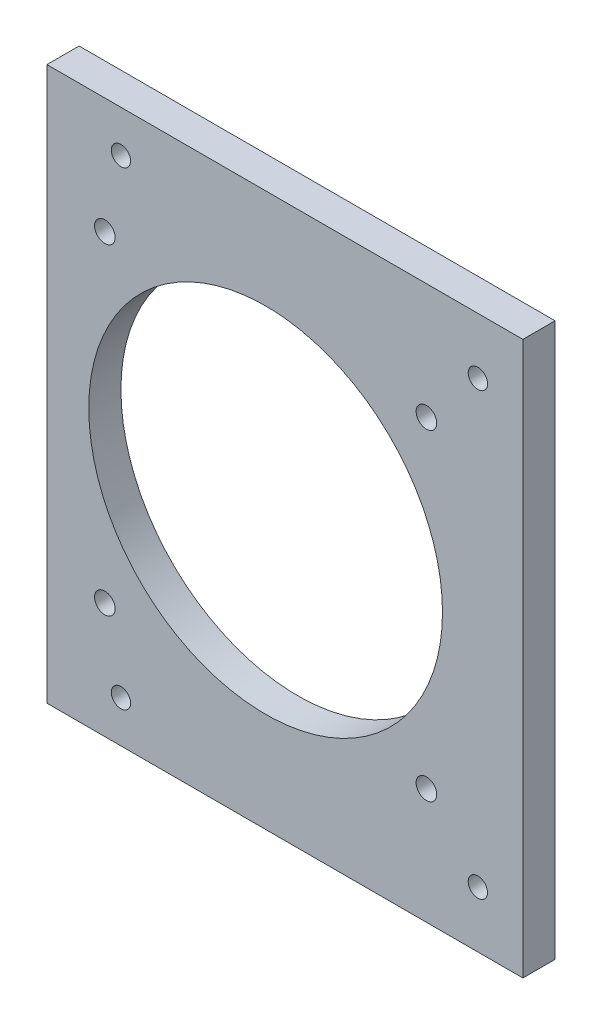
ISO-10303-21;
HEADER;
FILE_DESCRIPTION(('STEP AP214'),'2;1');
FILE_NAME('part.step','',(''),(''),'','','');
FILE_SCHEMA(('AUTOMOTIVE_DESIGN { 1 0 10303 214 1 1 1 1 }'));
ENDSEC;
DATA;
#1=APPLICATION_CONTEXT('core data for automotive mechanical design processes');
#2=APPLICATION_PROTOCOL_DEFINITION('international standard','automotive_design',2000,#1);
#3=PRODUCT_CONTEXT('',#1,'mechanical');
#4=PRODUCT('Part','Part','',(#3));
#5=PRODUCT_RELATED_PRODUCT_CATEGORY('part','',(#4));
#6=PRODUCT_DEFINITION_FORMATION('','',#4);
#7=PRODUCT_DEFINITION_CONTEXT('part definition',#1,'design');
#8=PRODUCT_DEFINITION('design','',#6,#7);
#9=PRODUCT_DEFINITION_SHAPE('','',#8);
#10=(LENGTH_UNIT() NAMED_UNIT(*) SI_UNIT(.MILLI.,.METRE.));
#11=(NAMED_UNIT(*) PLANE_ANGLE_UNIT() SI_UNIT($,.RADIAN.));
#12=(NAMED_UNIT(*) SI_UNIT($,.STERADIAN.) SOLID_ANGLE_UNIT());
#13=UNCERTAINTY_MEASURE_WITH_UNIT(LENGTH_MEASURE(1.E-05),#10,'distance_accuracy_value','');
#14=(GEOMETRIC_REPRESENTATION_CONTEXT(3) GLOBAL_UNCERTAINTY_ASSIGNED_CONTEXT((#13)) GLOBAL_UNIT_ASSIGNED_CONTEXT((#10,
#11,#12)) REPRESENTATION_CONTEXT('',''));
#15=CARTESIAN_POINT('',(0.,0.,0.));
#16=DIRECTION('',(0.,0.,1.));
#17=DIRECTION('',(1.,0.,0.));
#18=AXIS2_PLACEMENT_3D('',#15,#16,#17);
#19=CARTESIAN_POINT('',(2.50000000000003,-4.99999999999999,76.0000000000007));
#20=DIRECTION('',(1.,0.,0.));
#21=DIRECTION('',(0.,1.,0.));
#22=AXIS2_PLACEMENT_3D('',#19,#20,#21);
#23=PLANE('',#22);
#24=DIRECTION('',(0.,1.,0.));
#25=VECTOR('',#24,1.);
#26=CARTESIAN_POINT('',(2.50000000000003,-4.99999999999999,81.0000000000007));
#27=LINE('',#26,#25);
#28=CARTESIAN_POINT('',(2.50000000000003,2.00000000000001,81.0000000000007));
#29=VERTEX_POINT('',#28);
#30=CARTESIAN_POINT('',(2.50000000000002,88.,81.0000000000007));
#31=VERTEX_POINT('',#30);
#32=EDGE_CURVE('E37',#29,#31,#27,.T.);
#33=ORIENTED_EDGE('',*,*,#32,.F.);
#34=DIRECTION('',(0.,0.,1.));
#35=VECTOR('',#34,1.);
#36=CARTESIAN_POINT('',(2.50000000000003,2.00000000000001,76.0000000000007));
#37=LINE('',#36,#35);
#38=CARTESIAN_POINT('',(2.50000000000003,2.00000000000001,76.0000000000007));
#39=VERTEX_POINT('',#38);
#40=EDGE_CURVE('E73',#39,#29,#37,.T.);
#41=ORIENTED_EDGE('',*,*,#40,.F.);
#42=DIRECTION('',(0.,1.,0.));
#43=VECTOR('',#42,1.);
#44=CARTESIAN_POINT('',(2.50000000000003,-4.99999999999999,76.0000000000007));
#45=LINE('',#44,#43);
#46=CARTESIAN_POINT('',(2.50000000000002,88.,76.0000000000007));
#47=VERTEX_POINT('',#46);
#48=EDGE_CURVE('E11',#39,#47,#45,.T.);
#49=ORIENTED_EDGE('',*,*,#48,.T.);
#50=DIRECTION('',(0.,0.,-1.));
#51=VECTOR('',#50,1.);
#52=CARTESIAN_POINT('',(2.50000000000002,88.,81.0000000000007));
#53=LINE('',#52,#51);
#54=EDGE_CURVE('E90',#31,#47,#53,.T.);
#55=ORIENTED_EDGE('',*,*,#54,.F.);
#56=EDGE_LOOP('',(#33,#41,#49,#55));
#57=FACE_BOUND('',#56,.T.);
#58=ADVANCED_FACE('F34',(#57),#23,.T.);
#59=CARTESIAN_POINT('',(0.,0.,76.0000000000007));
#60=DIRECTION('',(0.,0.,1.));
#61=DIRECTION('',(1.,0.,0.));
#62=AXIS2_PLACEMENT_3D('',#59,#60,#61);
#63=PLANE('',#62);
#64=CARTESIAN_POINT('',(-37.4999999999983,45.,76.0000000000007));
#65=DIRECTION('',(0.,0.,1.));
#66=DIRECTION('',(1.,0.,0.));
#67=AXIS2_PLACEMENT_3D('',#64,#65,#66);
#68=CIRCLE('',#67,27.5);
#69=CARTESIAN_POINT('',(-9.9999999999983,45.,76.0000000000007));
#70=VERTEX_POINT('',#69);
#71=EDGE_CURVE('E140',#70,#70,#68,.T.);
#72=ORIENTED_EDGE('',*,*,#71,.T.);
#73=EDGE_LOOP('',(#72));
#74=FACE_BOUND('',#73,.T.);
#75=CARTESIAN_POINT('',(-62.4999999999983,70.,76.0000000000007));
#76=DIRECTION('',(0.,0.,1.));
#77=DIRECTION('',(1.,0.,0.));
#78=AXIS2_PLACEMENT_3D('',#75,#76,#77);
#79=CIRCLE('',#78,1.6);
#80=CARTESIAN_POINT('',(-60.8999999999983,70.,76.0000000000007));
#81=VERTEX_POINT('',#80);
#82=EDGE_CURVE('E134',#81,#81,#79,.T.);
#83=ORIENTED_EDGE('',*,*,#82,.T.);
#84=EDGE_LOOP('',(#83));
#85=FACE_BOUND('',#84,.T.);
#86=CARTESIAN_POINT('',(-62.4999999999983,20.,76.0000000000007));
#87=DIRECTION('',(0.,0.,1.));
#88=DIRECTION('',(1.,0.,0.));
#89=AXIS2_PLACEMENT_3D('',#86,#87,#88);
#90=CIRCLE('',#89,1.6);
#91=CARTESIAN_POINT('',(-60.8999999999983,20.,76.0000000000007));
#92=VERTEX_POINT('',#91);
#93=EDGE_CURVE('E128',#92,#92,#90,.T.);
#94=ORIENTED_EDGE('',*,*,#93,.T.);
#95=EDGE_LOOP('',(#94));
#96=FACE_BOUND('',#95,.T.);
#97=CARTESIAN_POINT('',(-12.4999999999983,20.,76.0000000000007));
#98=DIRECTION('',(0.,0.,1.));
#99=DIRECTION('',(1.,0.,0.));
#100=AXIS2_PLACEMENT_3D('',#97,#98,#99);
#101=CIRCLE('',#100,1.6);
#102=CARTESIAN_POINT('',(-10.8999999999983,20.,76.0000000000007));
#103=VERTEX_POINT('',#102);
#104=EDGE_CURVE('E122',#103,#103,#101,.T.);
#105=ORIENTED_EDGE('',*,*,#104,.T.);
#106=EDGE_LOOP('',(#105));
#107=FACE_BOUND('',#106,.T.);
#108=CARTESIAN_POINT('',(-12.4999999999983,70.,76.0000000000007));
#109=DIRECTION('',(0.,0.,1.));
#110=DIRECTION('',(1.,0.,0.));
#111=AXIS2_PLACEMENT_3D('',#108,#109,#110);
#112=CIRCLE('',#111,1.6);
#113=CARTESIAN_POINT('',(-10.8999999999983,70.,76.0000000000007));
#114=VERTEX_POINT('',#113);
#115=EDGE_CURVE('E116',#114,#114,#112,.T.);
#116=ORIENTED_EDGE('',*,*,#115,.T.);
#117=EDGE_LOOP('',(#116));
#118=FACE_BOUND('',#117,.T.);
#119=CARTESIAN_POINT('',(-4.49999999999956,10.75,76.0000000000007));
#120=DIRECTION('',(0.,0.,1.));
#121=DIRECTION('',(1.,0.,0.));
#122=AXIS2_PLACEMENT_3D('',#119,#120,#121);
#123=CIRCLE('',#122,1.49999999999959);
#124=CARTESIAN_POINT('',(-2.99999999999996,10.75,76.0000000000007));
#125=VERTEX_POINT('',#124);
#126=EDGE_CURVE('E110',#125,#125,#123,.T.);
#127=ORIENTED_EDGE('',*,*,#126,.T.);
#128=EDGE_LOOP('',(#127));
#129=FACE_BOUND('',#128,.T.);
#130=CARTESIAN_POINT('',(-4.49999999999956,79.25,76.0000000000007));
#131=DIRECTION('',(0.,0.,1.));
#132=DIRECTION('',(1.,0.,0.));
#133=AXIS2_PLACEMENT_3D('',#130,#131,#132);
#134=CIRCLE('',#133,1.49999999999961);
#135=CARTESIAN_POINT('',(-2.99999999999995,79.25,76.0000000000007));
#136=VERTEX_POINT('',#135);
#137=EDGE_CURVE('E104',#136,#136,#134,.T.);
#138=ORIENTED_EDGE('',*,*,#137,.T.);
#139=EDGE_LOOP('',(#138));
#140=FACE_BOUND('',#139,.T.);
#141=CARTESIAN_POINT('',(-59.9999999999996,81.5,76.0000000000007));
#142=DIRECTION('',(0.,0.,1.));
#143=DIRECTION('',(1.,0.,0.));
#144=AXIS2_PLACEMENT_3D('',#141,#142,#143);
#145=CIRCLE('',#144,1.4999999999996);
#146=CARTESIAN_POINT('',(-58.5,81.5,76.0000000000007));
#147=VERTEX_POINT('',#146);
#148=EDGE_CURVE('E98',#147,#147,#145,.T.);
#149=ORIENTED_EDGE('',*,*,#148,.T.);
#150=EDGE_LOOP('',(#149));
#151=FACE_BOUND('',#150,.T.);
#152=CARTESIAN_POINT('',(-59.9999999999983,8.50000000000006,76.0000000000007));
#153=DIRECTION('',(0.,0.,1.));
#154=DIRECTION('',(1.,0.,0.));
#155=AXIS2_PLACEMENT_3D('',#152,#153,#154);
#156=CIRCLE('',#155,1.49999999999842);
#157=CARTESIAN_POINT('',(-58.4999999999999,8.50000000000006,76.0000000000007));
#158=VERTEX_POINT('',#157);
#159=EDGE_CURVE('E91',#158,#158,#156,.T.);
#160=ORIENTED_EDGE('',*,*,#159,.T.);
#161=EDGE_LOOP('',(#160));
#162=FACE_BOUND('',#161,.T.);
#163=DIRECTION('',(1.,0.,0.));
#164=VECTOR('',#163,1.);
#165=CARTESIAN_POINT('',(-71.4999999999987,2.00000000000001,76.0000000000007));
#166=LINE('',#165,#164);
#167=CARTESIAN_POINT('',(-71.4999999999987,2.00000000000001,76.0000000000007));
#168=VERTEX_POINT('',#167);
#169=EDGE_CURVE('E76',#168,#39,#166,.T.);
#170=ORIENTED_EDGE('',*,*,#169,.F.);
#171=DIRECTION('',(0.,-1.,0.));
#172=VECTOR('',#171,1.);
#173=CARTESIAN_POINT('',(-71.4999999999987,95.,76.0000000000007));
#174=LINE('',#173,#172);
#175=CARTESIAN_POINT('',(-71.4999999999987,88.,76.0000000000007));
#176=VERTEX_POINT('',#175);
#177=EDGE_CURVE('E146',#176,#168,#174,.T.);
#178=ORIENTED_EDGE('',*,*,#177,.F.);
#179=DIRECTION('',(-1.,0.,0.));
#180=VECTOR('',#179,1.);
#181=CARTESIAN_POINT('',(2.50000000000002,88.,76.0000000000007));
#182=LINE('',#181,#180);
#183=EDGE_CURVE('E56',#47,#176,#182,.T.);
#184=ORIENTED_EDGE('',*,*,#183,.F.);
#185=ORIENTED_EDGE('',*,*,#48,.F.);
#186=EDGE_LOOP('',(#170,#178,#184,#185));
#187=FACE_BOUND('',#186,.T.);
#188=ADVANCED_FACE('F162',(#74,#85,#96,#107,#118,#129,#140,#151,#162,#187),#63,.F.);
#189=CARTESIAN_POINT('',(0.,0.,81.0000000000007));
#190=DIRECTION('',(0.,0.,1.));
#191=DIRECTION('',(1.,0.,0.));
#192=AXIS2_PLACEMENT_3D('',#189,#190,#191);
#193=PLANE('',#192);
#194=CARTESIAN_POINT('',(-37.4999999999983,45.,81.0000000000007));
#195=DIRECTION('',(0.,0.,1.));
#196=DIRECTION('',(1.,0.,0.));
#197=AXIS2_PLACEMENT_3D('',#194,#195,#196);
#198=CIRCLE('',#197,27.5);
#199=CARTESIAN_POINT('',(-9.9999999999983,45.,81.0000000000007));
#200=VERTEX_POINT('',#199);
#201=EDGE_CURVE('E143',#200,#200,#198,.T.);
#202=ORIENTED_EDGE('',*,*,#201,.F.);
#203=EDGE_LOOP('',(#202));
#204=FACE_BOUND('',#203,.T.);
#205=CARTESIAN_POINT('',(-62.4999999999983,70.,81.0000000000007));
#206=DIRECTION('',(0.,0.,1.));
#207=DIRECTION('',(1.,0.,0.));
#208=AXIS2_PLACEMENT_3D('',#205,#206,#207);
#209=CIRCLE('',#208,1.6);
#210=CARTESIAN_POINT('',(-60.8999999999983,70.,81.0000000000007));
#211=VERTEX_POINT('',#210);
#212=EDGE_CURVE('E137',#211,#211,#209,.T.);
#213=ORIENTED_EDGE('',*,*,#212,.F.);
#214=EDGE_LOOP('',(#213));
#215=FACE_BOUND('',#214,.T.);
#216=CARTESIAN_POINT('',(-62.4999999999983,20.,81.0000000000007));
#217=DIRECTION('',(0.,0.,1.));
#218=DIRECTION('',(1.,0.,0.));
#219=AXIS2_PLACEMENT_3D('',#216,#217,#218);
#220=CIRCLE('',#219,1.6);
#221=CARTESIAN_POINT('',(-60.8999999999983,20.,81.0000000000007));
#222=VERTEX_POINT('',#221);
#223=EDGE_CURVE('E131',#222,#222,#220,.T.);
#224=ORIENTED_EDGE('',*,*,#223,.F.);
#225=EDGE_LOOP('',(#224));
#226=FACE_BOUND('',#225,.T.);
#227=CARTESIAN_POINT('',(-12.4999999999983,20.,81.0000000000007));
#228=DIRECTION('',(0.,0.,1.));
#229=DIRECTION('',(1.,0.,0.));
#230=AXIS2_PLACEMENT_3D('',#227,#228,#229);
#231=CIRCLE('',#230,1.6);
#232=CARTESIAN_POINT('',(-10.8999999999983,20.,81.0000000000007));
#233=VERTEX_POINT('',#232);
#234=EDGE_CURVE('E125',#233,#233,#231,.T.);
#235=ORIENTED_EDGE('',*,*,#234,.F.);
#236=EDGE_LOOP('',(#235));
#237=FACE_BOUND('',#236,.T.);
#238=CARTESIAN_POINT('',(-12.4999999999983,70.,81.0000000000007));
#239=DIRECTION('',(0.,0.,1.));
#240=DIRECTION('',(1.,0.,0.));
#241=AXIS2_PLACEMENT_3D('',#238,#239,#240);
#242=CIRCLE('',#241,1.6);
#243=CARTESIAN_POINT('',(-10.8999999999983,70.,81.0000000000007));
#244=VERTEX_POINT('',#243);
#245=EDGE_CURVE('E119',#244,#244,#242,.T.);
#246=ORIENTED_EDGE('',*,*,#245,.F.);
#247=EDGE_LOOP('',(#246));
#248=FACE_BOUND('',#247,.T.);
#249=CARTESIAN_POINT('',(-4.49999999999956,10.75,81.0000000000007));
#250=DIRECTION('',(0.,0.,1.));
#251=DIRECTION('',(1.,0.,0.));
#252=AXIS2_PLACEMENT_3D('',#249,#250,#251);
#253=CIRCLE('',#252,1.49999999999959);
#254=CARTESIAN_POINT('',(-2.99999999999996,10.75,81.0000000000007));
#255=VERTEX_POINT('',#254);
#256=EDGE_CURVE('E113',#255,#255,#253,.T.);
#257=ORIENTED_EDGE('',*,*,#256,.F.);
#258=EDGE_LOOP('',(#257));
#259=FACE_BOUND('',#258,.T.);
#260=CARTESIAN_POINT('',(-4.49999999999956,79.25,81.0000000000007));
#261=DIRECTION('',(0.,0.,1.));
#262=DIRECTION('',(1.,0.,0.));
#263=AXIS2_PLACEMENT_3D('',#260,#261,#262);
#264=CIRCLE('',#263,1.49999999999961);
#265=CARTESIAN_POINT('',(-2.99999999999995,79.25,81.0000000000007));
#266=VERTEX_POINT('',#265);
#267=EDGE_CURVE('E107',#266,#266,#264,.T.);
#268=ORIENTED_EDGE('',*,*,#267,.F.);
#269=EDGE_LOOP('',(#268));
#270=FACE_BOUND('',#269,.T.);
#271=CARTESIAN_POINT('',(-59.9999999999996,81.5,81.0000000000007));
#272=DIRECTION('',(0.,0.,1.));
#273=DIRECTION('',(1.,0.,0.));
#274=AXIS2_PLACEMENT_3D('',#271,#272,#273);
#275=CIRCLE('',#274,1.4999999999996);
#276=CARTESIAN_POINT('',(-58.5,81.5,81.0000000000007));
#277=VERTEX_POINT('',#276);
#278=EDGE_CURVE('E101',#277,#277,#275,.T.);
#279=ORIENTED_EDGE('',*,*,#278,.F.);
#280=EDGE_LOOP('',(#279));
#281=FACE_BOUND('',#280,.T.);
#282=CARTESIAN_POINT('',(-59.9999999999983,8.50000000000006,81.0000000000007));
#283=DIRECTION('',(0.,0.,1.));
#284=DIRECTION('',(1.,0.,0.));
#285=AXIS2_PLACEMENT_3D('',#282,#283,#284);
#286=CIRCLE('',#285,1.49999999999842);
#287=CARTESIAN_POINT('',(-58.4999999999999,8.50000000000006,81.0000000000007));
#288=VERTEX_POINT('',#287);
#289=EDGE_CURVE('E93',#288,#288,#286,.T.);
#290=ORIENTED_EDGE('',*,*,#289,.F.);
#291=EDGE_LOOP('',(#290));
#292=FACE_BOUND('',#291,.T.);
#293=DIRECTION('',(0.,1.,0.));
#294=VECTOR('',#293,1.);
#295=CARTESIAN_POINT('',(-71.4999999999987,-4.99999999999999,81.0000000000007));
#296=LINE('',#295,#294);
#297=CARTESIAN_POINT('',(-71.4999999999987,2.00000000000001,81.0000000000007));
#298=VERTEX_POINT('',#297);
#299=CARTESIAN_POINT('',(-71.4999999999987,88.,81.0000000000007));
#300=VERTEX_POINT('',#299);
#301=EDGE_CURVE('E86',#298,#300,#296,.T.);
#302=ORIENTED_EDGE('',*,*,#301,.F.);
#303=DIRECTION('',(-1.,0.,0.));
#304=VECTOR('',#303,1.);
#305=CARTESIAN_POINT('',(2.50000000000003,2.00000000000001,81.0000000000007));
#306=LINE('',#305,#304);
#307=EDGE_CURVE('E48',#29,#298,#306,.T.);
#308=ORIENTED_EDGE('',*,*,#307,.F.);
#309=ORIENTED_EDGE('',*,*,#32,.T.);
#310=DIRECTION('',(1.,0.,0.));
#311=VECTOR('',#310,1.);
#312=CARTESIAN_POINT('',(-71.4999999999987,88.,81.0000000000007));
#313=LINE('',#312,#311);
#314=EDGE_CURVE('E154',#300,#31,#313,.T.);
#315=ORIENTED_EDGE('',*,*,#314,.F.);
#316=EDGE_LOOP('',(#302,#308,#309,#315));
#317=FACE_BOUND('',#316,.T.);
#318=ADVANCED_FACE('F83',(#204,#215,#226,#237,#248,#259,#270,#281,#292,#317),#193,.T.);
#319=CARTESIAN_POINT('',(-71.4999999999987,0.,0.));
#320=DIRECTION('',(-1.,0.,0.));
#321=DIRECTION('',(0.,0.,1.));
#322=AXIS2_PLACEMENT_3D('',#319,#320,#321);
#323=PLANE('',#322);
#324=ORIENTED_EDGE('',*,*,#177,.T.);
#325=DIRECTION('',(0.,0.,-1.));
#326=VECTOR('',#325,1.);
#327=CARTESIAN_POINT('',(-71.4999999999987,2.00000000000001,81.0000000000007));
#328=LINE('',#327,#326);
#329=EDGE_CURVE('E87',#298,#168,#328,.T.);
#330=ORIENTED_EDGE('',*,*,#329,.F.);
#331=ORIENTED_EDGE('',*,*,#301,.T.);
#332=DIRECTION('',(0.,0.,1.));
#333=VECTOR('',#332,1.);
#334=CARTESIAN_POINT('',(-71.4999999999987,88.,76.0000000000007));
#335=LINE('',#334,#333);
#336=EDGE_CURVE('E156',#176,#300,#335,.T.);
#337=ORIENTED_EDGE('',*,*,#336,.F.);
#338=EDGE_LOOP('',(#324,#330,#331,#337));
#339=FACE_BOUND('',#338,.T.);
#340=ADVANCED_FACE('F163',(#339),#323,.T.);
#341=CARTESIAN_POINT('',(-59.9999999999983,8.50000000000006,76.0000000000007));
#342=DIRECTION('',(0.,0.,1.));
#343=DIRECTION('',(1.,0.,0.));
#344=AXIS2_PLACEMENT_3D('',#341,#342,#343);
#345=CYLINDRICAL_SURFACE('',#344,1.49999999999842);
#346=ORIENTED_EDGE('',*,*,#159,.F.);
#347=EDGE_LOOP('',(#346));
#348=FACE_BOUND('',#347,.T.);
#349=ORIENTED_EDGE('',*,*,#289,.T.);
#350=EDGE_LOOP('',(#349));
#351=FACE_BOUND('',#350,.T.);
#352=ADVANCED_FACE('F189',(#348,#351),#345,.F.);
#353=CARTESIAN_POINT('',(-59.9999999999996,81.5,76.0000000000007));
#354=DIRECTION('',(0.,0.,1.));
#355=DIRECTION('',(1.,0.,0.));
#356=AXIS2_PLACEMENT_3D('',#353,#354,#355);
#357=CYLINDRICAL_SURFACE('',#356,1.4999999999996);
#358=ORIENTED_EDGE('',*,*,#148,.F.);
#359=EDGE_LOOP('',(#358));
#360=FACE_BOUND('',#359,.T.);
#361=ORIENTED_EDGE('',*,*,#278,.T.);
#362=EDGE_LOOP('',(#361));
#363=FACE_BOUND('',#362,.T.);
#364=ADVANCED_FACE('F192',(#360,#363),#357,.F.);
#365=CARTESIAN_POINT('',(-4.49999999999956,79.25,76.0000000000007));
#366=DIRECTION('',(0.,0.,1.));
#367=DIRECTION('',(1.,0.,0.));
#368=AXIS2_PLACEMENT_3D('',#365,#366,#367);
#369=CYLINDRICAL_SURFACE('',#368,1.49999999999961);
#370=ORIENTED_EDGE('',*,*,#137,.F.);
#371=EDGE_LOOP('',(#370));
#372=FACE_BOUND('',#371,.T.);
#373=ORIENTED_EDGE('',*,*,#267,.T.);
#374=EDGE_LOOP('',(#373));
#375=FACE_BOUND('',#374,.T.);
#376=ADVANCED_FACE('F196',(#372,#375),#369,.F.);
#377=CARTESIAN_POINT('',(-4.49999999999956,10.75,76.0000000000007));
#378=DIRECTION('',(0.,0.,1.));
#379=DIRECTION('',(1.,0.,0.));
#380=AXIS2_PLACEMENT_3D('',#377,#378,#379);
#381=CYLINDRICAL_SURFACE('',#380,1.49999999999959);
#382=ORIENTED_EDGE('',*,*,#126,.F.);
#383=EDGE_LOOP('',(#382));
#384=FACE_BOUND('',#383,.T.);
#385=ORIENTED_EDGE('',*,*,#256,.T.);
#386=EDGE_LOOP('',(#385));
#387=FACE_BOUND('',#386,.T.);
#388=ADVANCED_FACE('F200',(#384,#387),#381,.F.);
#389=CARTESIAN_POINT('',(-12.4999999999983,70.,76.0000000000007));
#390=DIRECTION('',(0.,0.,1.));
#391=DIRECTION('',(1.,0.,0.));
#392=AXIS2_PLACEMENT_3D('',#389,#390,#391);
#393=CYLINDRICAL_SURFACE('',#392,1.6);
#394=ORIENTED_EDGE('',*,*,#115,.F.);
#395=EDGE_LOOP('',(#394));
#396=FACE_BOUND('',#395,.T.);
#397=ORIENTED_EDGE('',*,*,#245,.T.);
#398=EDGE_LOOP('',(#397));
#399=FACE_BOUND('',#398,.T.);
#400=ADVANCED_FACE('F204',(#396,#399),#393,.F.);
#401=CARTESIAN_POINT('',(-12.4999999999983,20.,76.0000000000007));
#402=DIRECTION('',(0.,0.,1.));
#403=DIRECTION('',(1.,0.,0.));
#404=AXIS2_PLACEMENT_3D('',#401,#402,#403);
#405=CYLINDRICAL_SURFACE('',#404,1.6);
#406=ORIENTED_EDGE('',*,*,#104,.F.);
#407=EDGE_LOOP('',(#406));
#408=FACE_BOUND('',#407,.T.);
#409=ORIENTED_EDGE('',*,*,#234,.T.);
#410=EDGE_LOOP('',(#409));
#411=FACE_BOUND('',#410,.T.);
#412=ADVANCED_FACE('F208',(#408,#411),#405,.F.);
#413=CARTESIAN_POINT('',(-62.4999999999983,20.,76.0000000000007));
#414=DIRECTION('',(0.,0.,1.));
#415=DIRECTION('',(1.,0.,0.));
#416=AXIS2_PLACEMENT_3D('',#413,#414,#415);
#417=CYLINDRICAL_SURFACE('',#416,1.6);
#418=ORIENTED_EDGE('',*,*,#93,.F.);
#419=EDGE_LOOP('',(#418));
#420=FACE_BOUND('',#419,.T.);
#421=ORIENTED_EDGE('',*,*,#223,.T.);
#422=EDGE_LOOP('',(#421));
#423=FACE_BOUND('',#422,.T.);
#424=ADVANCED_FACE('F212',(#420,#423),#417,.F.);
#425=CARTESIAN_POINT('',(-62.4999999999983,70.,76.0000000000007));
#426=DIRECTION('',(0.,0.,1.));
#427=DIRECTION('',(1.,0.,0.));
#428=AXIS2_PLACEMENT_3D('',#425,#426,#427);
#429=CYLINDRICAL_SURFACE('',#428,1.6);
#430=ORIENTED_EDGE('',*,*,#82,.F.);
#431=EDGE_LOOP('',(#430));
#432=FACE_BOUND('',#431,.T.);
#433=ORIENTED_EDGE('',*,*,#212,.T.);
#434=EDGE_LOOP('',(#433));
#435=FACE_BOUND('',#434,.T.);
#436=ADVANCED_FACE('F173',(#432,#435),#429,.F.);
#437=CARTESIAN_POINT('',(-37.4999999999983,45.,76.0000000000007));
#438=DIRECTION('',(0.,0.,1.));
#439=DIRECTION('',(1.,0.,0.));
#440=AXIS2_PLACEMENT_3D('',#437,#438,#439);
#441=CYLINDRICAL_SURFACE('',#440,27.5);
#442=ORIENTED_EDGE('',*,*,#71,.F.);
#443=EDGE_LOOP('',(#442));
#444=FACE_BOUND('',#443,.T.);
#445=ORIENTED_EDGE('',*,*,#201,.T.);
#446=EDGE_LOOP('',(#445));
#447=FACE_BOUND('',#446,.T.);
#448=ADVANCED_FACE('F166',(#444,#447),#441,.F.);
#449=CARTESIAN_POINT('',(0.,88.,0.));
#450=DIRECTION('',(0.,1.,0.));
#451=DIRECTION('',(0.,0.,1.));
#452=AXIS2_PLACEMENT_3D('',#449,#450,#451);
#453=PLANE('',#452);
#454=ORIENTED_EDGE('',*,*,#336,.T.);
#455=ORIENTED_EDGE('',*,*,#314,.T.);
#456=ORIENTED_EDGE('',*,*,#54,.T.);
#457=ORIENTED_EDGE('',*,*,#183,.T.);
#458=EDGE_LOOP('',(#454,#455,#456,#457));
#459=FACE_BOUND('',#458,.T.);
#460=ADVANCED_FACE('F164',(#459),#453,.T.);
#461=CARTESIAN_POINT('',(0.,2.00000000000001,0.));
#462=DIRECTION('',(0.,-1.,0.));
#463=DIRECTION('',(0.,0.,-1.));
#464=AXIS2_PLACEMENT_3D('',#461,#462,#463);
#465=PLANE('',#464);
#466=ORIENTED_EDGE('',*,*,#40,.T.);
#467=ORIENTED_EDGE('',*,*,#307,.T.);
#468=ORIENTED_EDGE('',*,*,#329,.T.);
#469=ORIENTED_EDGE('',*,*,#169,.T.);
#470=EDGE_LOOP('',(#466,#467,#468,#469));
#471=FACE_BOUND('',#470,.T.);
#472=ADVANCED_FACE('F74',(#471),#465,.T.);
#473=CLOSED_SHELL('',(#58,#188,#318,#340,#352,#364,#376,#388,#400,#412,#424,#436,#448,#460,#472));
#474=MANIFOLD_SOLID_BREP('B2',#473);
#475=ADVANCED_BREP_SHAPE_REPRESENTATION('',(#18,#474),#14);
#476=SHAPE_DEFINITION_REPRESENTATION(#9,#475);
ENDSEC;
END-ISO-10303-21;
